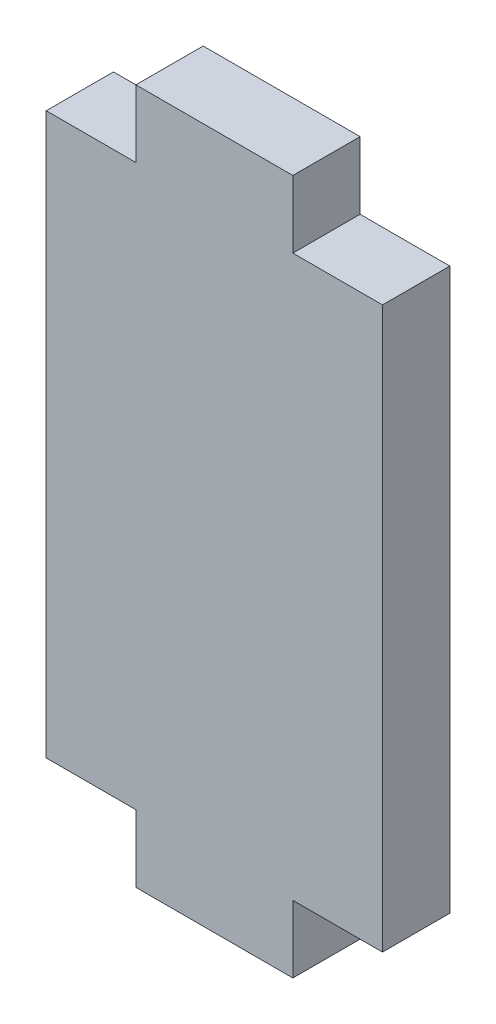
ISO-10303-21;
HEADER;
FILE_DESCRIPTION(('STEP AP214'),'2;1');
FILE_NAME('part.step','',(''),(''),'','','');
FILE_SCHEMA(('AUTOMOTIVE_DESIGN { 1 0 10303 214 1 1 1 1 }'));
ENDSEC;
DATA;
#1=APPLICATION_CONTEXT('core data for automotive mechanical design processes');
#2=APPLICATION_PROTOCOL_DEFINITION('international standard','automotive_design',2000,#1);
#3=PRODUCT_CONTEXT('',#1,'mechanical');
#4=PRODUCT('Part','Part','',(#3));
#5=PRODUCT_RELATED_PRODUCT_CATEGORY('part','',(#4));
#6=PRODUCT_DEFINITION_FORMATION('','',#4);
#7=PRODUCT_DEFINITION_CONTEXT('part definition',#1,'design');
#8=PRODUCT_DEFINITION('design','',#6,#7);
#9=PRODUCT_DEFINITION_SHAPE('','',#8);
#10=(LENGTH_UNIT() NAMED_UNIT(*) SI_UNIT(.MILLI.,.METRE.));
#11=(NAMED_UNIT(*) PLANE_ANGLE_UNIT() SI_UNIT($,.RADIAN.));
#12=(NAMED_UNIT(*) SI_UNIT($,.STERADIAN.) SOLID_ANGLE_UNIT());
#13=UNCERTAINTY_MEASURE_WITH_UNIT(LENGTH_MEASURE(1.E-05),#10,'distance_accuracy_value','');
#14=(GEOMETRIC_REPRESENTATION_CONTEXT(3) GLOBAL_UNCERTAINTY_ASSIGNED_CONTEXT((#13)) GLOBAL_UNIT_ASSIGNED_CONTEXT((#10,
#11,#12)) REPRESENTATION_CONTEXT('',''));
#15=CARTESIAN_POINT('',(0.,0.,0.));
#16=DIRECTION('',(0.,0.,1.));
#17=DIRECTION('',(1.,0.,0.));
#18=AXIS2_PLACEMENT_3D('',#15,#16,#17);
#19=CARTESIAN_POINT('',(3.5,-12.5,1.5));
#20=DIRECTION('',(0.,1.,0.));
#21=DIRECTION('',(0.,0.,1.));
#22=AXIS2_PLACEMENT_3D('',#19,#20,#21);
#23=PLANE('',#22);
#24=DIRECTION('',(1.,0.,0.));
#25=VECTOR('',#24,1.);
#26=CARTESIAN_POINT('',(3.5,-12.5,-1.5));
#27=LINE('',#26,#25);
#28=CARTESIAN_POINT('',(3.5,-12.5,-1.5));
#29=VERTEX_POINT('',#28);
#30=CARTESIAN_POINT('',(7.5,-12.5,-1.5));
#31=VERTEX_POINT('',#30);
#32=EDGE_CURVE('E153',#29,#31,#27,.T.);
#33=ORIENTED_EDGE('',*,*,#32,.T.);
#34=DIRECTION('',(0.,0.,-1.));
#35=VECTOR('',#34,1.);
#36=CARTESIAN_POINT('',(7.5,-12.5,1.5));
#37=LINE('',#36,#35);
#38=CARTESIAN_POINT('',(7.5,-12.5,1.5));
#39=VERTEX_POINT('',#38);
#40=EDGE_CURVE('E11',#39,#31,#37,.T.);
#41=ORIENTED_EDGE('',*,*,#40,.F.);
#42=DIRECTION('',(1.,0.,0.));
#43=VECTOR('',#42,1.);
#44=CARTESIAN_POINT('',(3.5,-12.5,1.5));
#45=LINE('',#44,#43);
#46=CARTESIAN_POINT('',(3.5,-12.5,1.5));
#47=VERTEX_POINT('',#46);
#48=EDGE_CURVE('E175',#47,#39,#45,.T.);
#49=ORIENTED_EDGE('',*,*,#48,.F.);
#50=DIRECTION('',(0.,0.,-1.));
#51=VECTOR('',#50,1.);
#52=CARTESIAN_POINT('',(3.5,-12.5,1.5));
#53=LINE('',#52,#51);
#54=EDGE_CURVE('E149',#47,#29,#53,.T.);
#55=ORIENTED_EDGE('',*,*,#54,.T.);
#56=EDGE_LOOP('',(#33,#41,#49,#55));
#57=FACE_BOUND('',#56,.T.);
#58=ADVANCED_FACE('F33',(#57),#23,.F.);
#59=CARTESIAN_POINT('',(7.5,12.5,1.5));
#60=DIRECTION('',(-1.,0.,0.));
#61=DIRECTION('',(0.,-1.,0.));
#62=AXIS2_PLACEMENT_3D('',#59,#60,#61);
#63=PLANE('',#62);
#64=DIRECTION('',(0.,1.,0.));
#65=VECTOR('',#64,1.);
#66=CARTESIAN_POINT('',(7.5,12.5,-1.5));
#67=LINE('',#66,#65);
#68=CARTESIAN_POINT('',(7.5,12.5,-1.5));
#69=VERTEX_POINT('',#68);
#70=EDGE_CURVE('E156',#31,#69,#67,.T.);
#71=ORIENTED_EDGE('',*,*,#70,.T.);
#72=DIRECTION('',(0.,0.,-1.));
#73=VECTOR('',#72,1.);
#74=CARTESIAN_POINT('',(7.5,12.5,1.5));
#75=LINE('',#74,#73);
#76=CARTESIAN_POINT('',(7.5,12.5,1.5));
#77=VERTEX_POINT('',#76);
#78=EDGE_CURVE('E41',#77,#69,#75,.T.);
#79=ORIENTED_EDGE('',*,*,#78,.F.);
#80=DIRECTION('',(0.,1.,0.));
#81=VECTOR('',#80,1.);
#82=CARTESIAN_POINT('',(7.5,12.5,1.5));
#83=LINE('',#82,#81);
#84=EDGE_CURVE('E104',#39,#77,#83,.T.);
#85=ORIENTED_EDGE('',*,*,#84,.F.);
#86=ORIENTED_EDGE('',*,*,#40,.T.);
#87=EDGE_LOOP('',(#71,#79,#85,#86));
#88=FACE_BOUND('',#87,.T.);
#89=ADVANCED_FACE('F253',(#88),#63,.F.);
#90=CARTESIAN_POINT('',(3.5,12.5,1.5));
#91=DIRECTION('',(0.,-1.,0.));
#92=DIRECTION('',(0.,0.,-1.));
#93=AXIS2_PLACEMENT_3D('',#90,#91,#92);
#94=PLANE('',#93);
#95=DIRECTION('',(-1.,0.,0.));
#96=VECTOR('',#95,1.);
#97=CARTESIAN_POINT('',(3.5,12.5,-1.5));
#98=LINE('',#97,#96);
#99=CARTESIAN_POINT('',(3.5,12.5,-1.5));
#100=VERTEX_POINT('',#99);
#101=EDGE_CURVE('E158',#69,#100,#98,.T.);
#102=ORIENTED_EDGE('',*,*,#101,.T.);
#103=DIRECTION('',(0.,0.,-1.));
#104=VECTOR('',#103,1.);
#105=CARTESIAN_POINT('',(3.5,12.5,1.5));
#106=LINE('',#105,#104);
#107=CARTESIAN_POINT('',(3.5,12.5,1.5));
#108=VERTEX_POINT('',#107);
#109=EDGE_CURVE('E194',#108,#100,#106,.T.);
#110=ORIENTED_EDGE('',*,*,#109,.F.);
#111=DIRECTION('',(-1.,0.,0.));
#112=VECTOR('',#111,1.);
#113=CARTESIAN_POINT('',(3.5,12.5,1.5));
#114=LINE('',#113,#112);
#115=EDGE_CURVE('E202',#77,#108,#114,.T.);
#116=ORIENTED_EDGE('',*,*,#115,.F.);
#117=ORIENTED_EDGE('',*,*,#78,.T.);
#118=EDGE_LOOP('',(#102,#110,#116,#117));
#119=FACE_BOUND('',#118,.T.);
#120=ADVANCED_FACE('F200',(#119),#94,.F.);
#121=CARTESIAN_POINT('',(3.5,12.5,1.5));
#122=DIRECTION('',(-1.,0.,0.));
#123=DIRECTION('',(0.,0.,1.));
#124=AXIS2_PLACEMENT_3D('',#121,#122,#123);
#125=PLANE('',#124);
#126=DIRECTION('',(0.,1.,0.));
#127=VECTOR('',#126,1.);
#128=CARTESIAN_POINT('',(3.5,12.5,-1.5));
#129=LINE('',#128,#127);
#130=CARTESIAN_POINT('',(3.5,15.5,-1.5));
#131=VERTEX_POINT('',#130);
#132=EDGE_CURVE('E160',#100,#131,#129,.T.);
#133=ORIENTED_EDGE('',*,*,#132,.T.);
#134=DIRECTION('',(0.,0.,-1.));
#135=VECTOR('',#134,1.);
#136=CARTESIAN_POINT('',(3.5,15.5,1.5));
#137=LINE('',#136,#135);
#138=CARTESIAN_POINT('',(3.5,15.5,1.5));
#139=VERTEX_POINT('',#138);
#140=EDGE_CURVE('E191',#139,#131,#137,.T.);
#141=ORIENTED_EDGE('',*,*,#140,.F.);
#142=DIRECTION('',(0.,1.,0.));
#143=VECTOR('',#142,1.);
#144=CARTESIAN_POINT('',(3.5,12.5,1.5));
#145=LINE('',#144,#143);
#146=EDGE_CURVE('E220',#108,#139,#145,.T.);
#147=ORIENTED_EDGE('',*,*,#146,.F.);
#148=ORIENTED_EDGE('',*,*,#109,.T.);
#149=EDGE_LOOP('',(#133,#141,#147,#148));
#150=FACE_BOUND('',#149,.T.);
#151=ADVANCED_FACE('F211',(#150),#125,.F.);
#152=CARTESIAN_POINT('',(-3.5,15.5,1.5));
#153=DIRECTION('',(0.,-1.,0.));
#154=DIRECTION('',(0.,0.,-1.));
#155=AXIS2_PLACEMENT_3D('',#152,#153,#154);
#156=PLANE('',#155);
#157=DIRECTION('',(-1.,0.,0.));
#158=VECTOR('',#157,1.);
#159=CARTESIAN_POINT('',(-3.5,15.5,-1.5));
#160=LINE('',#159,#158);
#161=CARTESIAN_POINT('',(-3.5,15.5,-1.5));
#162=VERTEX_POINT('',#161);
#163=EDGE_CURVE('E162',#131,#162,#160,.T.);
#164=ORIENTED_EDGE('',*,*,#163,.T.);
#165=DIRECTION('',(0.,0.,-1.));
#166=VECTOR('',#165,1.);
#167=CARTESIAN_POINT('',(-3.5,15.5,1.5));
#168=LINE('',#167,#166);
#169=CARTESIAN_POINT('',(-3.5,15.5,1.5));
#170=VERTEX_POINT('',#169);
#171=EDGE_CURVE('E188',#170,#162,#168,.T.);
#172=ORIENTED_EDGE('',*,*,#171,.F.);
#173=DIRECTION('',(-1.,0.,0.));
#174=VECTOR('',#173,1.);
#175=CARTESIAN_POINT('',(-3.5,15.5,1.5));
#176=LINE('',#175,#174);
#177=EDGE_CURVE('E217',#139,#170,#176,.T.);
#178=ORIENTED_EDGE('',*,*,#177,.F.);
#179=ORIENTED_EDGE('',*,*,#140,.T.);
#180=EDGE_LOOP('',(#164,#172,#178,#179));
#181=FACE_BOUND('',#180,.T.);
#182=ADVANCED_FACE('F215',(#181),#156,.F.);
#183=CARTESIAN_POINT('',(-3.5,12.5,1.5));
#184=DIRECTION('',(1.,0.,0.));
#185=DIRECTION('',(0.,0.,-1.));
#186=AXIS2_PLACEMENT_3D('',#183,#184,#185);
#187=PLANE('',#186);
#188=DIRECTION('',(0.,-1.,0.));
#189=VECTOR('',#188,1.);
#190=CARTESIAN_POINT('',(-3.5,12.5,-1.5));
#191=LINE('',#190,#189);
#192=CARTESIAN_POINT('',(-3.5,12.5,-1.5));
#193=VERTEX_POINT('',#192);
#194=EDGE_CURVE('E164',#162,#193,#191,.T.);
#195=ORIENTED_EDGE('',*,*,#194,.T.);
#196=DIRECTION('',(0.,0.,-1.));
#197=VECTOR('',#196,1.);
#198=CARTESIAN_POINT('',(-3.5,12.5,1.5));
#199=LINE('',#198,#197);
#200=CARTESIAN_POINT('',(-3.5,12.5,1.5));
#201=VERTEX_POINT('',#200);
#202=EDGE_CURVE('E185',#201,#193,#199,.T.);
#203=ORIENTED_EDGE('',*,*,#202,.F.);
#204=DIRECTION('',(0.,-1.,0.));
#205=VECTOR('',#204,1.);
#206=CARTESIAN_POINT('',(-3.5,12.5,1.5));
#207=LINE('',#206,#205);
#208=EDGE_CURVE('E219',#170,#201,#207,.T.);
#209=ORIENTED_EDGE('',*,*,#208,.F.);
#210=ORIENTED_EDGE('',*,*,#171,.T.);
#211=EDGE_LOOP('',(#195,#203,#209,#210));
#212=FACE_BOUND('',#211,.T.);
#213=ADVANCED_FACE('F266',(#212),#187,.F.);
#214=CARTESIAN_POINT('',(-7.5,12.5,1.5));
#215=DIRECTION('',(0.,-1.,0.));
#216=DIRECTION('',(0.,0.,-1.));
#217=AXIS2_PLACEMENT_3D('',#214,#215,#216);
#218=PLANE('',#217);
#219=DIRECTION('',(-1.,0.,0.));
#220=VECTOR('',#219,1.);
#221=CARTESIAN_POINT('',(-7.5,12.5,-1.5));
#222=LINE('',#221,#220);
#223=CARTESIAN_POINT('',(-7.5,12.5,-1.5));
#224=VERTEX_POINT('',#223);
#225=EDGE_CURVE('E166',#193,#224,#222,.T.);
#226=ORIENTED_EDGE('',*,*,#225,.T.);
#227=DIRECTION('',(0.,0.,-1.));
#228=VECTOR('',#227,1.);
#229=CARTESIAN_POINT('',(-7.5,12.5,1.5));
#230=LINE('',#229,#228);
#231=CARTESIAN_POINT('',(-7.5,12.5,1.5));
#232=VERTEX_POINT('',#231);
#233=EDGE_CURVE('E182',#232,#224,#230,.T.);
#234=ORIENTED_EDGE('',*,*,#233,.F.);
#235=DIRECTION('',(-1.,0.,0.));
#236=VECTOR('',#235,1.);
#237=CARTESIAN_POINT('',(-7.5,12.5,1.5));
#238=LINE('',#237,#236);
#239=EDGE_CURVE('E222',#201,#232,#238,.T.);
#240=ORIENTED_EDGE('',*,*,#239,.F.);
#241=ORIENTED_EDGE('',*,*,#202,.T.);
#242=EDGE_LOOP('',(#226,#234,#240,#241));
#243=FACE_BOUND('',#242,.T.);
#244=ADVANCED_FACE('F269',(#243),#218,.F.);
#245=CARTESIAN_POINT('',(-7.5,12.5,1.5));
#246=DIRECTION('',(1.,0.,0.));
#247=DIRECTION('',(0.,1.,0.));
#248=AXIS2_PLACEMENT_3D('',#245,#246,#247);
#249=PLANE('',#248);
#250=DIRECTION('',(0.,-1.,0.));
#251=VECTOR('',#250,1.);
#252=CARTESIAN_POINT('',(-7.5,12.5,-1.5));
#253=LINE('',#252,#251);
#254=CARTESIAN_POINT('',(-7.5,-12.5,-1.5));
#255=VERTEX_POINT('',#254);
#256=EDGE_CURVE('E168',#224,#255,#253,.T.);
#257=ORIENTED_EDGE('',*,*,#256,.T.);
#258=DIRECTION('',(0.,0.,-1.));
#259=VECTOR('',#258,1.);
#260=CARTESIAN_POINT('',(-7.5,-12.5,1.5));
#261=LINE('',#260,#259);
#262=CARTESIAN_POINT('',(-7.5,-12.5,1.5));
#263=VERTEX_POINT('',#262);
#264=EDGE_CURVE('E179',#263,#255,#261,.T.);
#265=ORIENTED_EDGE('',*,*,#264,.F.);
#266=DIRECTION('',(0.,-1.,0.));
#267=VECTOR('',#266,1.);
#268=CARTESIAN_POINT('',(-7.5,12.5,1.5));
#269=LINE('',#268,#267);
#270=EDGE_CURVE('E228',#232,#263,#269,.T.);
#271=ORIENTED_EDGE('',*,*,#270,.F.);
#272=ORIENTED_EDGE('',*,*,#233,.T.);
#273=EDGE_LOOP('',(#257,#265,#271,#272));
#274=FACE_BOUND('',#273,.T.);
#275=ADVANCED_FACE('F234',(#274),#249,.F.);
#276=CARTESIAN_POINT('',(-7.5,-12.5,1.5));
#277=DIRECTION('',(0.,1.,0.));
#278=DIRECTION('',(0.,0.,1.));
#279=AXIS2_PLACEMENT_3D('',#276,#277,#278);
#280=PLANE('',#279);
#281=DIRECTION('',(1.,0.,0.));
#282=VECTOR('',#281,1.);
#283=CARTESIAN_POINT('',(-7.5,-12.5,-1.5));
#284=LINE('',#283,#282);
#285=CARTESIAN_POINT('',(-3.5,-12.5,-1.5));
#286=VERTEX_POINT('',#285);
#287=EDGE_CURVE('E170',#255,#286,#284,.T.);
#288=ORIENTED_EDGE('',*,*,#287,.T.);
#289=DIRECTION('',(0.,0.,-1.));
#290=VECTOR('',#289,1.);
#291=CARTESIAN_POINT('',(-3.5,-12.5,1.5));
#292=LINE('',#291,#290);
#293=CARTESIAN_POINT('',(-3.5,-12.5,1.5));
#294=VERTEX_POINT('',#293);
#295=EDGE_CURVE('E144',#294,#286,#292,.T.);
#296=ORIENTED_EDGE('',*,*,#295,.F.);
#297=DIRECTION('',(1.,0.,0.));
#298=VECTOR('',#297,1.);
#299=CARTESIAN_POINT('',(-7.5,-12.5,1.5));
#300=LINE('',#299,#298);
#301=EDGE_CURVE('E135',#263,#294,#300,.T.);
#302=ORIENTED_EDGE('',*,*,#301,.F.);
#303=ORIENTED_EDGE('',*,*,#264,.T.);
#304=EDGE_LOOP('',(#288,#296,#302,#303));
#305=FACE_BOUND('',#304,.T.);
#306=ADVANCED_FACE('F238',(#305),#280,.F.);
#307=CARTESIAN_POINT('',(-3.5,-12.5,1.5));
#308=DIRECTION('',(1.,0.,0.));
#309=DIRECTION('',(0.,1.,0.));
#310=AXIS2_PLACEMENT_3D('',#307,#308,#309);
#311=PLANE('',#310);
#312=DIRECTION('',(0.,-1.,0.));
#313=VECTOR('',#312,1.);
#314=CARTESIAN_POINT('',(-3.5,-12.5,-1.5));
#315=LINE('',#314,#313);
#316=CARTESIAN_POINT('',(-3.5,-15.5,-1.5));
#317=VERTEX_POINT('',#316);
#318=EDGE_CURVE('E143',#286,#317,#315,.T.);
#319=ORIENTED_EDGE('',*,*,#318,.T.);
#320=DIRECTION('',(0.,0.,-1.));
#321=VECTOR('',#320,1.);
#322=CARTESIAN_POINT('',(-3.5,-15.5,1.5));
#323=LINE('',#322,#321);
#324=CARTESIAN_POINT('',(-3.5,-15.5,1.5));
#325=VERTEX_POINT('',#324);
#326=EDGE_CURVE('E140',#325,#317,#323,.T.);
#327=ORIENTED_EDGE('',*,*,#326,.F.);
#328=DIRECTION('',(0.,-1.,0.));
#329=VECTOR('',#328,1.);
#330=CARTESIAN_POINT('',(-3.5,-12.5,1.5));
#331=LINE('',#330,#329);
#332=EDGE_CURVE('E129',#294,#325,#331,.T.);
#333=ORIENTED_EDGE('',*,*,#332,.F.);
#334=ORIENTED_EDGE('',*,*,#295,.T.);
#335=EDGE_LOOP('',(#319,#327,#333,#334));
#336=FACE_BOUND('',#335,.T.);
#337=ADVANCED_FACE('F141',(#336),#311,.F.);
#338=CARTESIAN_POINT('',(-3.5,-15.5,1.5));
#339=DIRECTION('',(0.,1.,0.));
#340=DIRECTION('',(0.,0.,1.));
#341=AXIS2_PLACEMENT_3D('',#338,#339,#340);
#342=PLANE('',#341);
#343=DIRECTION('',(1.,0.,0.));
#344=VECTOR('',#343,1.);
#345=CARTESIAN_POINT('',(-3.5,-15.5,-1.5));
#346=LINE('',#345,#344);
#347=CARTESIAN_POINT('',(3.5,-15.5,-1.5));
#348=VERTEX_POINT('',#347);
#349=EDGE_CURVE('E90',#317,#348,#346,.T.);
#350=ORIENTED_EDGE('',*,*,#349,.T.);
#351=DIRECTION('',(0.,0.,-1.));
#352=VECTOR('',#351,1.);
#353=CARTESIAN_POINT('',(3.5,-15.5,1.5));
#354=LINE('',#353,#352);
#355=CARTESIAN_POINT('',(3.5,-15.5,1.5));
#356=VERTEX_POINT('',#355);
#357=EDGE_CURVE('E145',#356,#348,#354,.T.);
#358=ORIENTED_EDGE('',*,*,#357,.F.);
#359=DIRECTION('',(1.,0.,0.));
#360=VECTOR('',#359,1.);
#361=CARTESIAN_POINT('',(-3.5,-15.5,1.5));
#362=LINE('',#361,#360);
#363=EDGE_CURVE('E133',#325,#356,#362,.T.);
#364=ORIENTED_EDGE('',*,*,#363,.F.);
#365=ORIENTED_EDGE('',*,*,#326,.T.);
#366=EDGE_LOOP('',(#350,#358,#364,#365));
#367=FACE_BOUND('',#366,.T.);
#368=ADVANCED_FACE('F147',(#367),#342,.F.);
#369=CARTESIAN_POINT('',(3.5,-12.5,1.5));
#370=DIRECTION('',(-1.,0.,0.));
#371=DIRECTION('',(0.,-1.,0.));
#372=AXIS2_PLACEMENT_3D('',#369,#370,#371);
#373=PLANE('',#372);
#374=DIRECTION('',(0.,1.,0.));
#375=VECTOR('',#374,1.);
#376=CARTESIAN_POINT('',(3.5,-12.5,-1.5));
#377=LINE('',#376,#375);
#378=EDGE_CURVE('E96',#348,#29,#377,.T.);
#379=ORIENTED_EDGE('',*,*,#378,.T.);
#380=ORIENTED_EDGE('',*,*,#54,.F.);
#381=DIRECTION('',(0.,1.,0.));
#382=VECTOR('',#381,1.);
#383=CARTESIAN_POINT('',(3.5,-12.5,1.5));
#384=LINE('',#383,#382);
#385=EDGE_CURVE('E49',#356,#47,#384,.T.);
#386=ORIENTED_EDGE('',*,*,#385,.F.);
#387=ORIENTED_EDGE('',*,*,#357,.T.);
#388=EDGE_LOOP('',(#379,#380,#386,#387));
#389=FACE_BOUND('',#388,.T.);
#390=ADVANCED_FACE('F242',(#389),#373,.F.);
#391=CARTESIAN_POINT('',(0.,0.,1.5));
#392=DIRECTION('',(0.,0.,-1.));
#393=DIRECTION('',(-1.,0.,0.));
#394=AXIS2_PLACEMENT_3D('',#391,#392,#393);
#395=PLANE('',#394);
#396=ORIENTED_EDGE('',*,*,#48,.T.);
#397=ORIENTED_EDGE('',*,*,#84,.T.);
#398=ORIENTED_EDGE('',*,*,#115,.T.);
#399=ORIENTED_EDGE('',*,*,#146,.T.);
#400=ORIENTED_EDGE('',*,*,#177,.T.);
#401=ORIENTED_EDGE('',*,*,#208,.T.);
#402=ORIENTED_EDGE('',*,*,#239,.T.);
#403=ORIENTED_EDGE('',*,*,#270,.T.);
#404=ORIENTED_EDGE('',*,*,#301,.T.);
#405=ORIENTED_EDGE('',*,*,#332,.T.);
#406=ORIENTED_EDGE('',*,*,#363,.T.);
#407=ORIENTED_EDGE('',*,*,#385,.T.);
#408=EDGE_LOOP('',(#396,#397,#398,#399,#400,#401,#402,#403,#404,#405,#406,#407));
#409=FACE_BOUND('',#408,.T.);
#410=ADVANCED_FACE('F131',(#409),#395,.F.);
#411=CARTESIAN_POINT('',(0.,0.,-1.5));
#412=DIRECTION('',(0.,0.,-1.));
#413=DIRECTION('',(-1.,0.,0.));
#414=AXIS2_PLACEMENT_3D('',#411,#412,#413);
#415=PLANE('',#414);
#416=ORIENTED_EDGE('',*,*,#32,.F.);
#417=ORIENTED_EDGE('',*,*,#378,.F.);
#418=ORIENTED_EDGE('',*,*,#349,.F.);
#419=ORIENTED_EDGE('',*,*,#318,.F.);
#420=ORIENTED_EDGE('',*,*,#287,.F.);
#421=ORIENTED_EDGE('',*,*,#256,.F.);
#422=ORIENTED_EDGE('',*,*,#225,.F.);
#423=ORIENTED_EDGE('',*,*,#194,.F.);
#424=ORIENTED_EDGE('',*,*,#163,.F.);
#425=ORIENTED_EDGE('',*,*,#132,.F.);
#426=ORIENTED_EDGE('',*,*,#101,.F.);
#427=ORIENTED_EDGE('',*,*,#70,.F.);
#428=EDGE_LOOP('',(#416,#417,#418,#419,#420,#421,#422,#423,#424,#425,#426,#427));
#429=FACE_BOUND('',#428,.T.);
#430=ADVANCED_FACE('F206',(#429),#415,.T.);
#431=CLOSED_SHELL('',(#58,#89,#120,#151,#182,#213,#244,#275,#306,#337,#368,#390,#410,#430));
#432=MANIFOLD_SOLID_BREP('B2',#431);
#433=ADVANCED_BREP_SHAPE_REPRESENTATION('',(#18,#432),#14);
#434=SHAPE_DEFINITION_REPRESENTATION(#9,#433);
ENDSEC;
END-ISO-10303-21;
